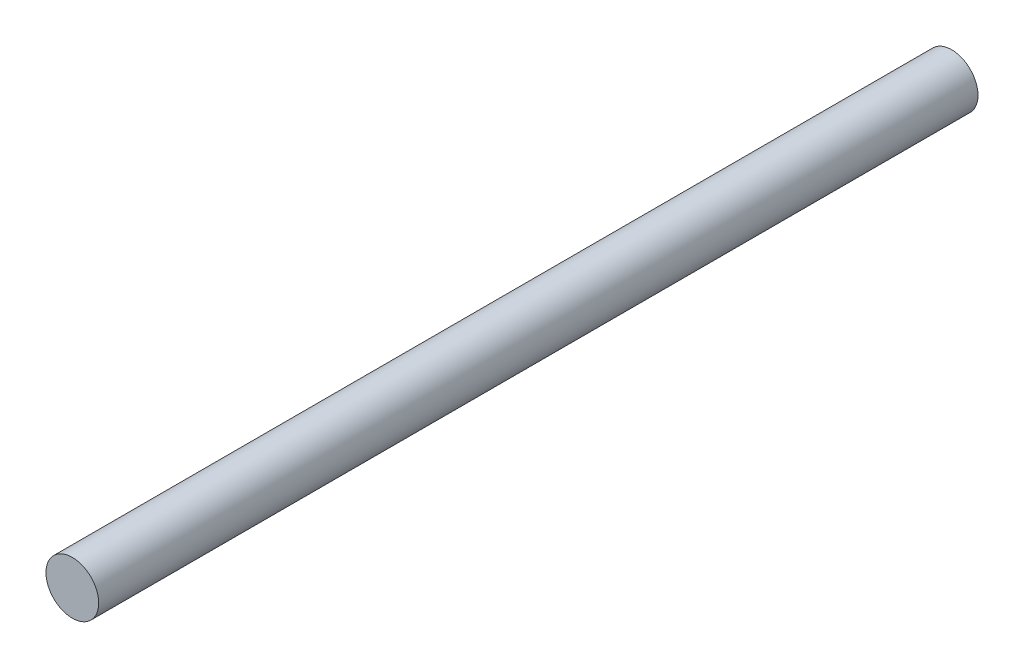
ISO-10303-21;
HEADER;
FILE_DESCRIPTION(('STEP AP214'),'2;1');
FILE_NAME('part.step','',(''),(''),'','','');
FILE_SCHEMA(('AUTOMOTIVE_DESIGN { 1 0 10303 214 1 1 1 1 }'));
ENDSEC;
DATA;
#1=APPLICATION_CONTEXT('core data for automotive mechanical design processes');
#2=APPLICATION_PROTOCOL_DEFINITION('international standard','automotive_design',2000,#1);
#3=PRODUCT_CONTEXT('',#1,'mechanical');
#4=PRODUCT('Part','Part','',(#3));
#5=PRODUCT_RELATED_PRODUCT_CATEGORY('part','',(#4));
#6=PRODUCT_DEFINITION_FORMATION('','',#4);
#7=PRODUCT_DEFINITION_CONTEXT('part definition',#1,'design');
#8=PRODUCT_DEFINITION('design','',#6,#7);
#9=PRODUCT_DEFINITION_SHAPE('','',#8);
#10=(LENGTH_UNIT() NAMED_UNIT(*) SI_UNIT(.MILLI.,.METRE.));
#11=(NAMED_UNIT(*) PLANE_ANGLE_UNIT() SI_UNIT($,.RADIAN.));
#12=(NAMED_UNIT(*) SI_UNIT($,.STERADIAN.) SOLID_ANGLE_UNIT());
#13=UNCERTAINTY_MEASURE_WITH_UNIT(LENGTH_MEASURE(1.E-05),#10,'distance_accuracy_value','');
#14=(GEOMETRIC_REPRESENTATION_CONTEXT(3) GLOBAL_UNCERTAINTY_ASSIGNED_CONTEXT((#13)) GLOBAL_UNIT_ASSIGNED_CONTEXT((#10,
#11,#12)) REPRESENTATION_CONTEXT('',''));
#15=CARTESIAN_POINT('',(0.,0.,0.));
#16=DIRECTION('',(0.,0.,1.));
#17=DIRECTION('',(1.,0.,0.));
#18=AXIS2_PLACEMENT_3D('',#15,#16,#17);
#19=CARTESIAN_POINT('',(0.,0.,50.));
#20=DIRECTION('',(0.,0.,-1.));
#21=DIRECTION('',(-1.,0.,0.));
#22=AXIS2_PLACEMENT_3D('',#19,#20,#21);
#23=CYLINDRICAL_SURFACE('',#22,1.5);
#24=CARTESIAN_POINT('',(0.,0.,50.));
#25=DIRECTION('',(0.,0.,1.));
#26=DIRECTION('',(1.,0.,0.));
#27=AXIS2_PLACEMENT_3D('',#24,#25,#26);
#28=CIRCLE('',#27,1.5);
#29=CARTESIAN_POINT('',(1.5,0.,50.));
#30=VERTEX_POINT('',#29);
#31=EDGE_CURVE('E10',#30,#30,#28,.T.);
#32=ORIENTED_EDGE('',*,*,#31,.F.);
#33=EDGE_LOOP('',(#32));
#34=FACE_BOUND('',#33,.T.);
#35=CARTESIAN_POINT('',(0.,0.,0.));
#36=DIRECTION('',(0.,0.,1.));
#37=DIRECTION('',(1.,0.,0.));
#38=AXIS2_PLACEMENT_3D('',#35,#36,#37);
#39=CIRCLE('',#38,1.5);
#40=CARTESIAN_POINT('',(1.5,0.,0.));
#41=VERTEX_POINT('',#40);
#42=EDGE_CURVE('E38',#41,#41,#39,.T.);
#43=ORIENTED_EDGE('',*,*,#42,.T.);
#44=EDGE_LOOP('',(#43));
#45=FACE_BOUND('',#44,.T.);
#46=ADVANCED_FACE('F35',(#34,#45),#23,.T.);
#47=CARTESIAN_POINT('',(0.,0.,50.));
#48=DIRECTION('',(0.,0.,1.));
#49=DIRECTION('',(1.,0.,0.));
#50=AXIS2_PLACEMENT_3D('',#47,#48,#49);
#51=PLANE('',#50);
#52=ORIENTED_EDGE('',*,*,#31,.T.);
#53=EDGE_LOOP('',(#52));
#54=FACE_BOUND('',#53,.T.);
#55=ADVANCED_FACE('F50',(#54),#51,.T.);
#56=CARTESIAN_POINT('',(0.,0.,0.));
#57=DIRECTION('',(0.,0.,1.));
#58=DIRECTION('',(1.,0.,0.));
#59=AXIS2_PLACEMENT_3D('',#56,#57,#58);
#60=PLANE('',#59);
#61=ORIENTED_EDGE('',*,*,#42,.F.);
#62=EDGE_LOOP('',(#61));
#63=FACE_BOUND('',#62,.T.);
#64=ADVANCED_FACE('F48',(#63),#60,.F.);
#65=CLOSED_SHELL('',(#46,#55,#64));
#66=MANIFOLD_SOLID_BREP('B2',#65);
#67=ADVANCED_BREP_SHAPE_REPRESENTATION('',(#18,#66),#14);
#68=SHAPE_DEFINITION_REPRESENTATION(#9,#67);
ENDSEC;
END-ISO-10303-21;
